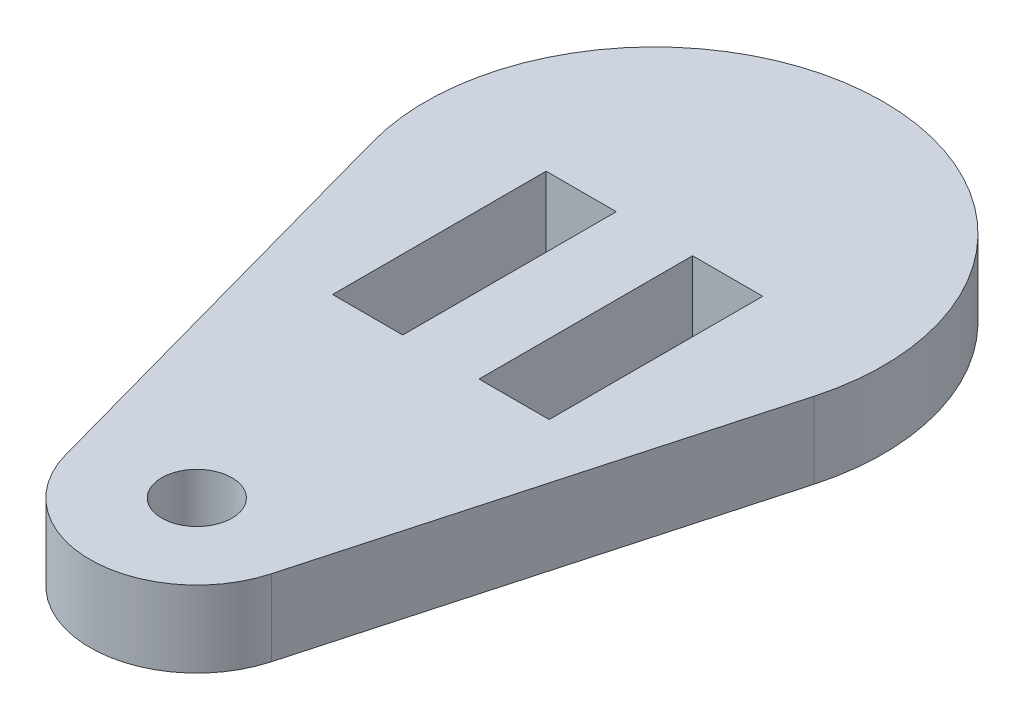
ISO-10303-21;
HEADER;
FILE_DESCRIPTION(('STEP AP214'),'2;1');
FILE_NAME('part.step','',(''),(''),'','','');
FILE_SCHEMA(('AUTOMOTIVE_DESIGN { 1 0 10303 214 1 1 1 1 }'));
ENDSEC;
DATA;
#1=APPLICATION_CONTEXT('core data for automotive mechanical design processes');
#2=APPLICATION_PROTOCOL_DEFINITION('international standard','automotive_design',2000,#1);
#3=PRODUCT_CONTEXT('',#1,'mechanical');
#4=PRODUCT('Part','Part','',(#3));
#5=PRODUCT_RELATED_PRODUCT_CATEGORY('part','',(#4));
#6=PRODUCT_DEFINITION_FORMATION('','',#4);
#7=PRODUCT_DEFINITION_CONTEXT('part definition',#1,'design');
#8=PRODUCT_DEFINITION('design','',#6,#7);
#9=PRODUCT_DEFINITION_SHAPE('','',#8);
#10=(LENGTH_UNIT() NAMED_UNIT(*) SI_UNIT(.MILLI.,.METRE.));
#11=(NAMED_UNIT(*) PLANE_ANGLE_UNIT() SI_UNIT($,.RADIAN.));
#12=(NAMED_UNIT(*) SI_UNIT($,.STERADIAN.) SOLID_ANGLE_UNIT());
#13=UNCERTAINTY_MEASURE_WITH_UNIT(LENGTH_MEASURE(1.E-05),#10,'distance_accuracy_value','');
#14=(GEOMETRIC_REPRESENTATION_CONTEXT(3) GLOBAL_UNCERTAINTY_ASSIGNED_CONTEXT((#13)) GLOBAL_UNIT_ASSIGNED_CONTEXT((#10,
#11,#12)) REPRESENTATION_CONTEXT('',''));
#15=CARTESIAN_POINT('',(0.,0.,0.));
#16=DIRECTION('',(0.,0.,1.));
#17=DIRECTION('',(1.,0.,0.));
#18=AXIS2_PLACEMENT_3D('',#15,#16,#17);
#19=CARTESIAN_POINT('',(0.,1.5875,0.));
#20=DIRECTION('',(0.,1.,0.));
#21=DIRECTION('',(0.,0.,1.));
#22=AXIS2_PLACEMENT_3D('',#19,#20,#21);
#23=PLANE('',#22);
#24=DIRECTION('',(0.,0.,1.));
#25=VECTOR('',#24,1.);
#26=CARTESIAN_POINT('',(-4.5085,1.5875,0.));
#27=LINE('',#26,#25);
#28=CARTESIAN_POINT('',(-4.5085,1.5875,0.));
#29=VERTEX_POINT('',#28);
#30=CARTESIAN_POINT('',(-4.5085,1.5875,8.89));
#31=VERTEX_POINT('',#30);
#32=EDGE_CURVE('E188',#29,#31,#27,.T.);
#33=ORIENTED_EDGE('',*,*,#32,.F.);
#34=DIRECTION('',(-1.,0.,0.));
#35=VECTOR('',#34,1.);
#36=CARTESIAN_POINT('',(0.,1.5875,0.));
#37=LINE('',#36,#35);
#38=CARTESIAN_POINT('',(-1.5875,1.5875,0.));
#39=VERTEX_POINT('',#38);
#40=EDGE_CURVE('E186',#39,#29,#37,.T.);
#41=ORIENTED_EDGE('',*,*,#40,.F.);
#42=DIRECTION('',(0.,0.,-1.));
#43=VECTOR('',#42,1.);
#44=CARTESIAN_POINT('',(-1.5875,1.5875,0.));
#45=LINE('',#44,#43);
#46=CARTESIAN_POINT('',(-1.5875,1.5875,8.89));
#47=VERTEX_POINT('',#46);
#48=EDGE_CURVE('E184',#47,#39,#45,.T.);
#49=ORIENTED_EDGE('',*,*,#48,.F.);
#50=DIRECTION('',(1.,0.,0.));
#51=VECTOR('',#50,1.);
#52=CARTESIAN_POINT('',(0.,1.5875,8.89));
#53=LINE('',#52,#51);
#54=EDGE_CURVE('E175',#31,#47,#53,.T.);
#55=ORIENTED_EDGE('',*,*,#54,.F.);
#56=EDGE_LOOP('',(#33,#41,#49,#55));
#57=FACE_BOUND('',#56,.T.);
#58=CARTESIAN_POINT('',(0.,1.5875,19.05));
#59=DIRECTION('',(0.,1.,0.));
#60=DIRECTION('',(0.,0.,1.));
#61=AXIS2_PLACEMENT_3D('',#58,#59,#60);
#62=CIRCLE('',#61,1.4605);
#63=CARTESIAN_POINT('',(0.,1.5875,20.5105));
#64=VERTEX_POINT('',#63);
#65=EDGE_CURVE('E192',#64,#64,#62,.T.);
#66=ORIENTED_EDGE('',*,*,#65,.F.);
#67=EDGE_LOOP('',(#66));
#68=FACE_BOUND('',#67,.T.);
#69=DIRECTION('',(0.266666666666667,0.,0.963788819653397));
#70=VECTOR('',#69,1.);
#71=CARTESIAN_POINT('',(-9.18008850719861,1.5875,2.54));
#72=LINE('',#71,#70);
#73=CARTESIAN_POINT('',(-9.18008850719861,1.5875,2.54));
#74=VERTEX_POINT('',#73);
#75=CARTESIAN_POINT('',(-4.28404130335934,1.5875,20.2353333333333));
#76=VERTEX_POINT('',#75);
#77=EDGE_CURVE('E195',#74,#76,#72,.T.);
#78=ORIENTED_EDGE('',*,*,#77,.T.);
#79=CARTESIAN_POINT('',(0.,1.5875,19.05));
#80=DIRECTION('',(0.,1.,0.));
#81=DIRECTION('',(0.,0.,1.));
#82=AXIS2_PLACEMENT_3D('',#79,#80,#81);
#83=CIRCLE('',#82,4.445);
#84=CARTESIAN_POINT('',(4.28404130335935,1.5875,20.2353333333333));
#85=VERTEX_POINT('',#84);
#86=EDGE_CURVE('E199',#76,#85,#83,.T.);
#87=ORIENTED_EDGE('',*,*,#86,.T.);
#88=DIRECTION('',(-0.266666666666667,0.,0.963788819653397));
#89=VECTOR('',#88,1.);
#90=CARTESIAN_POINT('',(9.18008850719861,1.5875,2.54));
#91=LINE('',#90,#89);
#92=CARTESIAN_POINT('',(9.18008850719861,1.5875,2.54));
#93=VERTEX_POINT('',#92);
#94=EDGE_CURVE('E201',#93,#85,#91,.T.);
#95=ORIENTED_EDGE('',*,*,#94,.F.);
#96=CARTESIAN_POINT('',(0.,1.5875,0.));
#97=DIRECTION('',(0.,1.,0.));
#98=DIRECTION('',(0.,0.,1.));
#99=AXIS2_PLACEMENT_3D('',#96,#97,#98);
#100=CIRCLE('',#99,9.525);
#101=EDGE_CURVE('E204',#93,#74,#100,.T.);
#102=ORIENTED_EDGE('',*,*,#101,.T.);
#103=EDGE_LOOP('',(#78,#87,#95,#102));
#104=FACE_BOUND('',#103,.T.);
#105=DIRECTION('',(1.,0.,0.));
#106=VECTOR('',#105,1.);
#107=CARTESIAN_POINT('',(0.,1.5875,0.));
#108=LINE('',#107,#106);
#109=CARTESIAN_POINT('',(1.5875,1.5875,0.));
#110=VERTEX_POINT('',#109);
#111=CARTESIAN_POINT('',(4.5085,1.5875,0.));
#112=VERTEX_POINT('',#111);
#113=EDGE_CURVE('E146',#110,#112,#108,.T.);
#114=ORIENTED_EDGE('',*,*,#113,.T.);
#115=DIRECTION('',(0.,0.,1.));
#116=VECTOR('',#115,1.);
#117=CARTESIAN_POINT('',(4.5085,1.5875,0.));
#118=LINE('',#117,#116);
#119=CARTESIAN_POINT('',(4.5085,1.5875,8.89));
#120=VERTEX_POINT('',#119);
#121=EDGE_CURVE('E134',#112,#120,#118,.T.);
#122=ORIENTED_EDGE('',*,*,#121,.T.);
#123=DIRECTION('',(-1.,0.,0.));
#124=VECTOR('',#123,1.);
#125=CARTESIAN_POINT('',(0.,1.5875,8.89));
#126=LINE('',#125,#124);
#127=CARTESIAN_POINT('',(1.5875,1.5875,8.89));
#128=VERTEX_POINT('',#127);
#129=EDGE_CURVE('E155',#120,#128,#126,.T.);
#130=ORIENTED_EDGE('',*,*,#129,.T.);
#131=DIRECTION('',(0.,0.,-1.));
#132=VECTOR('',#131,1.);
#133=CARTESIAN_POINT('',(1.5875,1.5875,0.));
#134=LINE('',#133,#132);
#135=EDGE_CURVE('E152',#128,#110,#134,.T.);
#136=ORIENTED_EDGE('',*,*,#135,.T.);
#137=EDGE_LOOP('',(#114,#122,#130,#136));
#138=FACE_BOUND('',#137,.T.);
#139=ADVANCED_FACE('F35',(#57,#68,#104,#138),#23,.T.);
#140=CARTESIAN_POINT('',(0.,-1.5875,0.));
#141=DIRECTION('',(0.,1.,0.));
#142=DIRECTION('',(0.,0.,1.));
#143=AXIS2_PLACEMENT_3D('',#140,#141,#142);
#144=PLANE('',#143);
#145=DIRECTION('',(0.266666666666667,0.,0.963788819653397));
#146=VECTOR('',#145,1.);
#147=CARTESIAN_POINT('',(-9.18008850719861,-1.5875,2.54));
#148=LINE('',#147,#146);
#149=CARTESIAN_POINT('',(-9.18008850719861,-1.5875,2.54));
#150=VERTEX_POINT('',#149);
#151=CARTESIAN_POINT('',(-4.28404130335934,-1.5875,20.2353333333333));
#152=VERTEX_POINT('',#151);
#153=EDGE_CURVE('E209',#150,#152,#148,.T.);
#154=ORIENTED_EDGE('',*,*,#153,.F.);
#155=CARTESIAN_POINT('',(0.,-1.5875,0.));
#156=DIRECTION('',(0.,1.,0.));
#157=DIRECTION('',(0.,0.,1.));
#158=AXIS2_PLACEMENT_3D('',#155,#156,#157);
#159=CIRCLE('',#158,9.525);
#160=CARTESIAN_POINT('',(9.18008850719861,-1.5875,2.54));
#161=VERTEX_POINT('',#160);
#162=EDGE_CURVE('E196',#161,#150,#159,.T.);
#163=ORIENTED_EDGE('',*,*,#162,.F.);
#164=DIRECTION('',(-0.266666666666667,0.,0.963788819653397));
#165=VECTOR('',#164,1.);
#166=CARTESIAN_POINT('',(9.18008850719861,-1.5875,2.54));
#167=LINE('',#166,#165);
#168=CARTESIAN_POINT('',(4.28404130335935,-1.5875,20.2353333333333));
#169=VERTEX_POINT('',#168);
#170=EDGE_CURVE('E215',#161,#169,#167,.T.);
#171=ORIENTED_EDGE('',*,*,#170,.T.);
#172=CARTESIAN_POINT('',(0.,-1.5875,19.05));
#173=DIRECTION('',(0.,1.,0.));
#174=DIRECTION('',(0.,0.,1.));
#175=AXIS2_PLACEMENT_3D('',#172,#173,#174);
#176=CIRCLE('',#175,4.445);
#177=EDGE_CURVE('E212',#152,#169,#176,.T.);
#178=ORIENTED_EDGE('',*,*,#177,.F.);
#179=EDGE_LOOP('',(#154,#163,#171,#178));
#180=FACE_BOUND('',#179,.T.);
#181=CARTESIAN_POINT('',(0.,-1.5875,19.05));
#182=DIRECTION('',(0.,1.,0.));
#183=DIRECTION('',(0.,0.,1.));
#184=AXIS2_PLACEMENT_3D('',#181,#182,#183);
#185=CIRCLE('',#184,1.4605);
#186=CARTESIAN_POINT('',(0.,-1.5875,20.5105));
#187=VERTEX_POINT('',#186);
#188=EDGE_CURVE('E191',#187,#187,#185,.T.);
#189=ORIENTED_EDGE('',*,*,#188,.T.);
#190=EDGE_LOOP('',(#189));
#191=FACE_BOUND('',#190,.T.);
#192=DIRECTION('',(-1.,0.,0.));
#193=VECTOR('',#192,1.);
#194=CARTESIAN_POINT('',(-1.5875,-1.5875,0.));
#195=LINE('',#194,#193);
#196=CARTESIAN_POINT('',(-1.5875,-1.5875,0.));
#197=VERTEX_POINT('',#196);
#198=CARTESIAN_POINT('',(-4.5085,-1.5875,0.));
#199=VERTEX_POINT('',#198);
#200=EDGE_CURVE('E168',#197,#199,#195,.T.);
#201=ORIENTED_EDGE('',*,*,#200,.T.);
#202=DIRECTION('',(0.,0.,1.));
#203=VECTOR('',#202,1.);
#204=CARTESIAN_POINT('',(-4.5085,-1.5875,0.));
#205=LINE('',#204,#203);
#206=CARTESIAN_POINT('',(-4.5085,-1.5875,8.89));
#207=VERTEX_POINT('',#206);
#208=EDGE_CURVE('E159',#199,#207,#205,.T.);
#209=ORIENTED_EDGE('',*,*,#208,.T.);
#210=DIRECTION('',(1.,0.,0.));
#211=VECTOR('',#210,1.);
#212=CARTESIAN_POINT('',(-1.5875,-1.5875,8.89));
#213=LINE('',#212,#211);
#214=CARTESIAN_POINT('',(-1.5875,-1.5875,8.89));
#215=VERTEX_POINT('',#214);
#216=EDGE_CURVE('E162',#207,#215,#213,.T.);
#217=ORIENTED_EDGE('',*,*,#216,.T.);
#218=DIRECTION('',(0.,0.,-1.));
#219=VECTOR('',#218,1.);
#220=CARTESIAN_POINT('',(-1.5875,-1.5875,0.));
#221=LINE('',#220,#219);
#222=EDGE_CURVE('E165',#215,#197,#221,.T.);
#223=ORIENTED_EDGE('',*,*,#222,.T.);
#224=EDGE_LOOP('',(#201,#209,#217,#223));
#225=FACE_BOUND('',#224,.T.);
#226=DIRECTION('',(0.,0.,1.));
#227=VECTOR('',#226,1.);
#228=CARTESIAN_POINT('',(4.5085,-1.5875,0.));
#229=LINE('',#228,#227);
#230=CARTESIAN_POINT('',(4.5085,-1.5875,0.));
#231=VERTEX_POINT('',#230);
#232=CARTESIAN_POINT('',(4.5085,-1.5875,8.89));
#233=VERTEX_POINT('',#232);
#234=EDGE_CURVE('E127',#231,#233,#229,.T.);
#235=ORIENTED_EDGE('',*,*,#234,.F.);
#236=DIRECTION('',(1.,0.,0.));
#237=VECTOR('',#236,1.);
#238=CARTESIAN_POINT('',(1.5875,-1.5875,0.));
#239=LINE('',#238,#237);
#240=CARTESIAN_POINT('',(1.5875,-1.5875,0.));
#241=VERTEX_POINT('',#240);
#242=EDGE_CURVE('E121',#241,#231,#239,.T.);
#243=ORIENTED_EDGE('',*,*,#242,.F.);
#244=DIRECTION('',(0.,0.,-1.));
#245=VECTOR('',#244,1.);
#246=CARTESIAN_POINT('',(1.5875,-1.5875,0.));
#247=LINE('',#246,#245);
#248=CARTESIAN_POINT('',(1.5875,-1.5875,8.89));
#249=VERTEX_POINT('',#248);
#250=EDGE_CURVE('E126',#249,#241,#247,.T.);
#251=ORIENTED_EDGE('',*,*,#250,.F.);
#252=DIRECTION('',(-1.,0.,0.));
#253=VECTOR('',#252,1.);
#254=CARTESIAN_POINT('',(1.5875,-1.5875,8.89));
#255=LINE('',#254,#253);
#256=EDGE_CURVE('E136',#233,#249,#255,.T.);
#257=ORIENTED_EDGE('',*,*,#256,.F.);
#258=EDGE_LOOP('',(#235,#243,#251,#257));
#259=FACE_BOUND('',#258,.T.);
#260=ADVANCED_FACE('F139',(#180,#191,#225,#259),#144,.F.);
#261=CARTESIAN_POINT('',(-9.18008850719861,1.5875,2.54));
#262=DIRECTION('',(0.963788819653397,0.,-0.266666666666667));
#263=DIRECTION('',(-0.266666666666667,0.,-0.963788819653397));
#264=AXIS2_PLACEMENT_3D('',#261,#262,#263);
#265=PLANE('',#264);
#266=ORIENTED_EDGE('',*,*,#153,.T.);
#267=DIRECTION('',(0.,-1.,0.));
#268=VECTOR('',#267,1.);
#269=CARTESIAN_POINT('',(-4.28404130335934,1.5875,20.2353333333333));
#270=LINE('',#269,#268);
#271=EDGE_CURVE('E11',#76,#152,#270,.T.);
#272=ORIENTED_EDGE('',*,*,#271,.F.);
#273=ORIENTED_EDGE('',*,*,#77,.F.);
#274=DIRECTION('',(0.,-1.,0.));
#275=VECTOR('',#274,1.);
#276=CARTESIAN_POINT('',(-9.18008850719861,1.5875,2.54));
#277=LINE('',#276,#275);
#278=EDGE_CURVE('E206',#74,#150,#277,.T.);
#279=ORIENTED_EDGE('',*,*,#278,.T.);
#280=EDGE_LOOP('',(#266,#272,#273,#279));
#281=FACE_BOUND('',#280,.T.);
#282=ADVANCED_FACE('F240',(#281),#265,.F.);
#283=CARTESIAN_POINT('',(0.,1.5875,19.05));
#284=DIRECTION('',(0.,-1.,0.));
#285=DIRECTION('',(0.,0.,-1.));
#286=AXIS2_PLACEMENT_3D('',#283,#284,#285);
#287=CYLINDRICAL_SURFACE('',#286,4.445);
#288=ORIENTED_EDGE('',*,*,#177,.T.);
#289=DIRECTION('',(0.,-1.,0.));
#290=VECTOR('',#289,1.);
#291=CARTESIAN_POINT('',(4.28404130335935,1.5875,20.2353333333333));
#292=LINE('',#291,#290);
#293=EDGE_CURVE('E43',#85,#169,#292,.T.);
#294=ORIENTED_EDGE('',*,*,#293,.F.);
#295=ORIENTED_EDGE('',*,*,#86,.F.);
#296=ORIENTED_EDGE('',*,*,#271,.T.);
#297=EDGE_LOOP('',(#288,#294,#295,#296));
#298=FACE_BOUND('',#297,.T.);
#299=ADVANCED_FACE('F228',(#298),#287,.T.);
#300=CARTESIAN_POINT('',(9.18008850719861,1.5875,2.54));
#301=DIRECTION('',(0.963788819653397,0.,0.266666666666667));
#302=DIRECTION('',(0.266666666666667,0.,-0.963788819653397));
#303=AXIS2_PLACEMENT_3D('',#300,#301,#302);
#304=PLANE('',#303);
#305=ORIENTED_EDGE('',*,*,#170,.F.);
#306=DIRECTION('',(0.,-1.,0.));
#307=VECTOR('',#306,1.);
#308=CARTESIAN_POINT('',(9.18008850719861,1.5875,2.54));
#309=LINE('',#308,#307);
#310=EDGE_CURVE('E221',#93,#161,#309,.T.);
#311=ORIENTED_EDGE('',*,*,#310,.F.);
#312=ORIENTED_EDGE('',*,*,#94,.T.);
#313=ORIENTED_EDGE('',*,*,#293,.T.);
#314=EDGE_LOOP('',(#305,#311,#312,#313));
#315=FACE_BOUND('',#314,.T.);
#316=ADVANCED_FACE('F225',(#315),#304,.T.);
#317=CARTESIAN_POINT('',(0.,1.5875,19.05));
#318=DIRECTION('',(0.,-1.,0.));
#319=DIRECTION('',(0.,0.,-1.));
#320=AXIS2_PLACEMENT_3D('',#317,#318,#319);
#321=CYLINDRICAL_SURFACE('',#320,1.4605);
#322=ORIENTED_EDGE('',*,*,#65,.T.);
#323=EDGE_LOOP('',(#322));
#324=FACE_BOUND('',#323,.T.);
#325=ORIENTED_EDGE('',*,*,#188,.F.);
#326=EDGE_LOOP('',(#325));
#327=FACE_BOUND('',#326,.T.);
#328=ADVANCED_FACE('F37',(#324,#327),#321,.F.);
#329=CARTESIAN_POINT('',(0.,1.5875,0.));
#330=DIRECTION('',(0.,-1.,0.));
#331=DIRECTION('',(0.,0.,-1.));
#332=AXIS2_PLACEMENT_3D('',#329,#330,#331);
#333=CYLINDRICAL_SURFACE('',#332,9.525);
#334=ORIENTED_EDGE('',*,*,#162,.T.);
#335=ORIENTED_EDGE('',*,*,#278,.F.);
#336=ORIENTED_EDGE('',*,*,#101,.F.);
#337=ORIENTED_EDGE('',*,*,#310,.T.);
#338=EDGE_LOOP('',(#334,#335,#336,#337));
#339=FACE_BOUND('',#338,.T.);
#340=ADVANCED_FACE('F236',(#339),#333,.T.);
#341=CARTESIAN_POINT('',(-4.5085,-1.5875,0.));
#342=DIRECTION('',(-1.,0.,0.));
#343=DIRECTION('',(0.,0.,1.));
#344=AXIS2_PLACEMENT_3D('',#341,#342,#343);
#345=PLANE('',#344);
#346=ORIENTED_EDGE('',*,*,#32,.T.);
#347=DIRECTION('',(0.,1.,0.));
#348=VECTOR('',#347,1.);
#349=CARTESIAN_POINT('',(-4.5085,-1.5875,8.89));
#350=LINE('',#349,#348);
#351=EDGE_CURVE('E171',#207,#31,#350,.T.);
#352=ORIENTED_EDGE('',*,*,#351,.F.);
#353=ORIENTED_EDGE('',*,*,#208,.F.);
#354=DIRECTION('',(0.,1.,0.));
#355=VECTOR('',#354,1.);
#356=CARTESIAN_POINT('',(-4.5085,-1.5875,0.));
#357=LINE('',#356,#355);
#358=EDGE_CURVE('E172',#199,#29,#357,.T.);
#359=ORIENTED_EDGE('',*,*,#358,.T.);
#360=EDGE_LOOP('',(#346,#352,#353,#359));
#361=FACE_BOUND('',#360,.T.);
#362=ADVANCED_FACE('F267',(#361),#345,.F.);
#363=CARTESIAN_POINT('',(-1.5875,-1.5875,0.));
#364=DIRECTION('',(0.,0.,-1.));
#365=DIRECTION('',(-1.,0.,0.));
#366=AXIS2_PLACEMENT_3D('',#363,#364,#365);
#367=PLANE('',#366);
#368=ORIENTED_EDGE('',*,*,#40,.T.);
#369=ORIENTED_EDGE('',*,*,#358,.F.);
#370=ORIENTED_EDGE('',*,*,#200,.F.);
#371=DIRECTION('',(0.,1.,0.));
#372=VECTOR('',#371,1.);
#373=CARTESIAN_POINT('',(-1.5875,-1.5875,0.));
#374=LINE('',#373,#372);
#375=EDGE_CURVE('E176',#197,#39,#374,.T.);
#376=ORIENTED_EDGE('',*,*,#375,.T.);
#377=EDGE_LOOP('',(#368,#369,#370,#376));
#378=FACE_BOUND('',#377,.T.);
#379=ADVANCED_FACE('F263',(#378),#367,.F.);
#380=CARTESIAN_POINT('',(-1.5875,-1.5875,0.));
#381=DIRECTION('',(1.,0.,0.));
#382=DIRECTION('',(0.,0.,-1.));
#383=AXIS2_PLACEMENT_3D('',#380,#381,#382);
#384=PLANE('',#383);
#385=ORIENTED_EDGE('',*,*,#48,.T.);
#386=ORIENTED_EDGE('',*,*,#375,.F.);
#387=ORIENTED_EDGE('',*,*,#222,.F.);
#388=DIRECTION('',(0.,1.,0.));
#389=VECTOR('',#388,1.);
#390=CARTESIAN_POINT('',(-1.5875,-1.5875,8.89));
#391=LINE('',#390,#389);
#392=EDGE_CURVE('E179',#215,#47,#391,.T.);
#393=ORIENTED_EDGE('',*,*,#392,.T.);
#394=EDGE_LOOP('',(#385,#386,#387,#393));
#395=FACE_BOUND('',#394,.T.);
#396=ADVANCED_FACE('F266',(#395),#384,.F.);
#397=CARTESIAN_POINT('',(-1.5875,-1.5875,8.89));
#398=DIRECTION('',(0.,0.,1.));
#399=DIRECTION('',(1.,0.,0.));
#400=AXIS2_PLACEMENT_3D('',#397,#398,#399);
#401=PLANE('',#400);
#402=ORIENTED_EDGE('',*,*,#54,.T.);
#403=ORIENTED_EDGE('',*,*,#392,.F.);
#404=ORIENTED_EDGE('',*,*,#216,.F.);
#405=ORIENTED_EDGE('',*,*,#351,.T.);
#406=EDGE_LOOP('',(#402,#403,#404,#405));
#407=FACE_BOUND('',#406,.T.);
#408=ADVANCED_FACE('F258',(#407),#401,.F.);
#409=CARTESIAN_POINT('',(4.5085,-1.5875,0.));
#410=DIRECTION('',(-1.,0.,0.));
#411=DIRECTION('',(0.,0.,1.));
#412=AXIS2_PLACEMENT_3D('',#409,#410,#411);
#413=PLANE('',#412);
#414=DIRECTION('',(0.,1.,0.));
#415=VECTOR('',#414,1.);
#416=CARTESIAN_POINT('',(4.5085,-1.5875,0.));
#417=LINE('',#416,#415);
#418=EDGE_CURVE('E50',#231,#112,#417,.T.);
#419=ORIENTED_EDGE('',*,*,#418,.F.);
#420=ORIENTED_EDGE('',*,*,#234,.T.);
#421=DIRECTION('',(0.,1.,0.));
#422=VECTOR('',#421,1.);
#423=CARTESIAN_POINT('',(4.5085,-1.5875,8.89));
#424=LINE('',#423,#422);
#425=EDGE_CURVE('E144',#233,#120,#424,.T.);
#426=ORIENTED_EDGE('',*,*,#425,.T.);
#427=ORIENTED_EDGE('',*,*,#121,.F.);
#428=EDGE_LOOP('',(#419,#420,#426,#427));
#429=FACE_BOUND('',#428,.T.);
#430=ADVANCED_FACE('F130',(#429),#413,.T.);
#431=CARTESIAN_POINT('',(1.5875,-1.5875,8.89));
#432=DIRECTION('',(0.,0.,-1.));
#433=DIRECTION('',(-1.,0.,0.));
#434=AXIS2_PLACEMENT_3D('',#431,#432,#433);
#435=PLANE('',#434);
#436=ORIENTED_EDGE('',*,*,#425,.F.);
#437=ORIENTED_EDGE('',*,*,#256,.T.);
#438=DIRECTION('',(0.,1.,0.));
#439=VECTOR('',#438,1.);
#440=CARTESIAN_POINT('',(1.5875,-1.5875,8.89));
#441=LINE('',#440,#439);
#442=EDGE_CURVE('E147',#249,#128,#441,.T.);
#443=ORIENTED_EDGE('',*,*,#442,.T.);
#444=ORIENTED_EDGE('',*,*,#129,.F.);
#445=EDGE_LOOP('',(#436,#437,#443,#444));
#446=FACE_BOUND('',#445,.T.);
#447=ADVANCED_FACE('F250',(#446),#435,.T.);
#448=CARTESIAN_POINT('',(1.5875,-1.5875,0.));
#449=DIRECTION('',(1.,0.,0.));
#450=DIRECTION('',(0.,0.,-1.));
#451=AXIS2_PLACEMENT_3D('',#448,#449,#450);
#452=PLANE('',#451);
#453=ORIENTED_EDGE('',*,*,#442,.F.);
#454=ORIENTED_EDGE('',*,*,#250,.T.);
#455=DIRECTION('',(0.,1.,0.));
#456=VECTOR('',#455,1.);
#457=CARTESIAN_POINT('',(1.5875,-1.5875,0.));
#458=LINE('',#457,#456);
#459=EDGE_CURVE('E55',#241,#110,#458,.T.);
#460=ORIENTED_EDGE('',*,*,#459,.T.);
#461=ORIENTED_EDGE('',*,*,#135,.F.);
#462=EDGE_LOOP('',(#453,#454,#460,#461));
#463=FACE_BOUND('',#462,.T.);
#464=ADVANCED_FACE('F248',(#463),#452,.T.);
#465=CARTESIAN_POINT('',(1.5875,-1.5875,0.));
#466=DIRECTION('',(0.,0.,1.));
#467=DIRECTION('',(1.,0.,0.));
#468=AXIS2_PLACEMENT_3D('',#465,#466,#467);
#469=PLANE('',#468);
#470=ORIENTED_EDGE('',*,*,#459,.F.);
#471=ORIENTED_EDGE('',*,*,#242,.T.);
#472=ORIENTED_EDGE('',*,*,#418,.T.);
#473=ORIENTED_EDGE('',*,*,#113,.F.);
#474=EDGE_LOOP('',(#470,#471,#472,#473));
#475=FACE_BOUND('',#474,.T.);
#476=ADVANCED_FACE('F122',(#475),#469,.T.);
#477=CLOSED_SHELL('',(#139,#260,#282,#299,#316,#328,#340,#362,#379,#396,#408,#430,#447,#464,#476));
#478=MANIFOLD_SOLID_BREP('B2',#477);
#479=ADVANCED_BREP_SHAPE_REPRESENTATION('',(#18,#478),#14);
#480=SHAPE_DEFINITION_REPRESENTATION(#9,#479);
ENDSEC;
END-ISO-10303-21;
